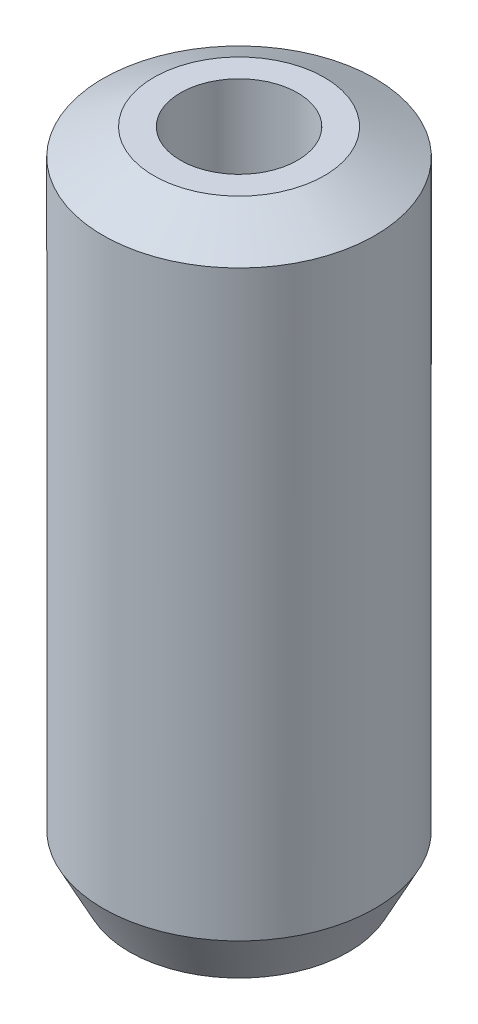
ISO-10303-21;
HEADER;
FILE_DESCRIPTION(('STEP AP214'),'2;1');
FILE_NAME('part.step','',(''),(''),'','','');
FILE_SCHEMA(('AUTOMOTIVE_DESIGN { 1 0 10303 214 1 1 1 1 }'));
ENDSEC;
DATA;
#1=APPLICATION_CONTEXT('core data for automotive mechanical design processes');
#2=APPLICATION_PROTOCOL_DEFINITION('international standard','automotive_design',2000,#1);
#3=PRODUCT_CONTEXT('',#1,'mechanical');
#4=PRODUCT('Part','Part','',(#3));
#5=PRODUCT_RELATED_PRODUCT_CATEGORY('part','',(#4));
#6=PRODUCT_DEFINITION_FORMATION('','',#4);
#7=PRODUCT_DEFINITION_CONTEXT('part definition',#1,'design');
#8=PRODUCT_DEFINITION('design','',#6,#7);
#9=PRODUCT_DEFINITION_SHAPE('','',#8);
#10=(LENGTH_UNIT() NAMED_UNIT(*) SI_UNIT(.MILLI.,.METRE.));
#11=(NAMED_UNIT(*) PLANE_ANGLE_UNIT() SI_UNIT($,.RADIAN.));
#12=(NAMED_UNIT(*) SI_UNIT($,.STERADIAN.) SOLID_ANGLE_UNIT());
#13=UNCERTAINTY_MEASURE_WITH_UNIT(LENGTH_MEASURE(1.E-05),#10,'distance_accuracy_value','');
#14=(GEOMETRIC_REPRESENTATION_CONTEXT(3) GLOBAL_UNCERTAINTY_ASSIGNED_CONTEXT((#13)) GLOBAL_UNIT_ASSIGNED_CONTEXT((#10,
#11,#12)) REPRESENTATION_CONTEXT('',''));
#15=CARTESIAN_POINT('',(0.,0.,0.));
#16=DIRECTION('',(0.,0.,1.));
#17=DIRECTION('',(1.,0.,0.));
#18=AXIS2_PLACEMENT_3D('',#15,#16,#17);
#19=CARTESIAN_POINT('',(0.,72.7821540167197,0.));
#20=DIRECTION('',(0.,-1.,0.));
#21=DIRECTION('',(0.,0.,-1.));
#22=AXIS2_PLACEMENT_3D('',#19,#20,#21);
#23=CYLINDRICAL_SURFACE('',#22,15.);
#24=CARTESIAN_POINT('',(0.,69.8770734885181,0.));
#25=DIRECTION('',(0.,1.,0.));
#26=DIRECTION('',(0.,0.,1.));
#27=AXIS2_PLACEMENT_3D('',#24,#25,#26);
#28=CIRCLE('',#27,15.);
#29=CARTESIAN_POINT('',(0.,69.8770734885181,-15.));
#30=VERTEX_POINT('',#29);
#31=EDGE_CURVE('E50',#30,#30,#28,.F.);
#32=ORIENTED_EDGE('',*,*,#31,.T.);
#33=EDGE_LOOP('',(#32));
#34=FACE_BOUND('',#33,.T.);
#35=CARTESIAN_POINT('',(0.,5.59851978660866,0.));
#36=DIRECTION('',(0.,1.,0.));
#37=DIRECTION('',(0.,0.,1.));
#38=AXIS2_PLACEMENT_3D('',#35,#36,#37);
#39=CIRCLE('',#38,15.);
#40=CARTESIAN_POINT('',(0.,5.59851978660866,15.));
#41=VERTEX_POINT('',#40);
#42=EDGE_CURVE('E51',#41,#41,#39,.T.);
#43=ORIENTED_EDGE('',*,*,#42,.T.);
#44=EDGE_LOOP('',(#43));
#45=FACE_BOUND('',#44,.T.);
#46=ADVANCED_FACE('F39',(#34,#45),#23,.T.);
#47=CARTESIAN_POINT('',(0.,72.7821540167197,0.));
#48=DIRECTION('',(0.,1.,0.));
#49=DIRECTION('',(0.,0.,1.));
#50=AXIS2_PLACEMENT_3D('',#47,#48,#49);
#51=PLANE('',#50);
#52=CARTESIAN_POINT('',(0.,72.7821540167197,0.));
#53=DIRECTION('',(0.,1.,0.));
#54=DIRECTION('',(0.,0.,1.));
#55=AXIS2_PLACEMENT_3D('',#52,#53,#54);
#56=CIRCLE('',#55,9.40148021339141);
#57=CARTESIAN_POINT('',(0.,72.7821540167197,-9.40148021339142));
#58=VERTEX_POINT('',#57);
#59=EDGE_CURVE('E54',#58,#58,#56,.T.);
#60=ORIENTED_EDGE('',*,*,#59,.T.);
#61=EDGE_LOOP('',(#60));
#62=FACE_BOUND('',#61,.T.);
#63=CARTESIAN_POINT('',(0.,72.7821540167197,0.));
#64=DIRECTION('',(0.,1.,0.));
#65=DIRECTION('',(0.,0.,1.));
#66=AXIS2_PLACEMENT_3D('',#63,#64,#65);
#67=CIRCLE('',#66,6.45590871518805);
#68=CARTESIAN_POINT('',(0.,72.7821540167197,6.45590871518805));
#69=VERTEX_POINT('',#68);
#70=EDGE_CURVE('E58',#69,#69,#67,.T.);
#71=ORIENTED_EDGE('',*,*,#70,.F.);
#72=EDGE_LOOP('',(#71));
#73=FACE_BOUND('',#72,.T.);
#74=ADVANCED_FACE('F69',(#62,#73),#51,.T.);
#75=CARTESIAN_POINT('',(0.,0.,0.));
#76=DIRECTION('',(0.,1.,0.));
#77=DIRECTION('',(0.,0.,1.));
#78=AXIS2_PLACEMENT_3D('',#75,#76,#77);
#79=PLANE('',#78);
#80=CARTESIAN_POINT('',(0.,0.,0.));
#81=DIRECTION('',(0.,1.,0.));
#82=DIRECTION('',(0.,0.,1.));
#83=AXIS2_PLACEMENT_3D('',#80,#81,#82);
#84=CIRCLE('',#83,12.0949194717984);
#85=CARTESIAN_POINT('',(0.,0.,12.0949194717984));
#86=VERTEX_POINT('',#85);
#87=EDGE_CURVE('E10',#86,#86,#84,.F.);
#88=ORIENTED_EDGE('',*,*,#87,.T.);
#89=EDGE_LOOP('',(#88));
#90=FACE_BOUND('',#89,.T.);
#91=CARTESIAN_POINT('',(0.,0.,0.));
#92=DIRECTION('',(0.,1.,0.));
#93=DIRECTION('',(0.,0.,1.));
#94=AXIS2_PLACEMENT_3D('',#91,#92,#93);
#95=CIRCLE('',#94,6.45590871518805);
#96=CARTESIAN_POINT('',(0.,0.,6.45590871518805));
#97=VERTEX_POINT('',#96);
#98=EDGE_CURVE('E63',#97,#97,#95,.T.);
#99=ORIENTED_EDGE('',*,*,#98,.T.);
#100=EDGE_LOOP('',(#99));
#101=FACE_BOUND('',#100,.T.);
#102=ADVANCED_FACE('F75',(#90,#101),#79,.F.);
#103=CARTESIAN_POINT('',(0.,72.7821540167197,0.));
#104=DIRECTION('',(0.,-1.,0.));
#105=DIRECTION('',(0.,0.,-1.));
#106=AXIS2_PLACEMENT_3D('',#103,#104,#105);
#107=CYLINDRICAL_SURFACE('',#106,6.45590871518805);
#108=ORIENTED_EDGE('',*,*,#70,.T.);
#109=EDGE_LOOP('',(#108));
#110=FACE_BOUND('',#109,.T.);
#111=ORIENTED_EDGE('',*,*,#98,.F.);
#112=EDGE_LOOP('',(#111));
#113=FACE_BOUND('',#112,.T.);
#114=ADVANCED_FACE('F70',(#110,#113),#107,.F.);
#115=CARTESIAN_POINT('',(0.,72.7821540167197,0.));
#116=DIRECTION('',(0.,-1.,0.));
#117=DIRECTION('',(0.,0.,-1.));
#118=AXIS2_PLACEMENT_3D('',#115,#116,#117);
#119=CONICAL_SURFACE('',#118,9.40148021339141,1.09214208184919);
#120=CARTESIAN_POINT('',(0.,69.8770734885181,-15.));
#121=CARTESIAN_POINT('',(0.,69.9073347440202,-14.9416820855562));
#122=CARTESIAN_POINT('',(0.,69.9375959995223,-14.8833641711123));
#123=CARTESIAN_POINT('',(0.,69.9981185105265,-14.7667283422247));
#124=CARTESIAN_POINT('',(0.,70.0283797660286,-14.7084104277808));
#125=CARTESIAN_POINT('',(0.,70.0889022770328,-14.5917745988931));
#126=CARTESIAN_POINT('',(0.,70.1191635325349,-14.5334566844493));
#127=CARTESIAN_POINT('',(0.,70.1796860435391,-14.4168208555616));
#128=CARTESIAN_POINT('',(0.,70.2099472990412,-14.3585029411178));
#129=CARTESIAN_POINT('',(0.,70.2704698100454,-14.2418671122301));
#130=CARTESIAN_POINT('',(0.,70.3007310655475,-14.1835491977863));
#131=CARTESIAN_POINT('',(0.,70.3612535765517,-14.0669133688986));
#132=CARTESIAN_POINT('',(0.,70.3915148320538,-14.0085954544547));
#133=CARTESIAN_POINT('',(0.,70.452037343058,-13.8919596255671));
#134=CARTESIAN_POINT('',(0.,70.4822985985601,-13.8336417111232));
#135=CARTESIAN_POINT('',(0.,70.5428211095643,-13.7170058822355));
#136=CARTESIAN_POINT('',(0.,70.5730823650664,-13.6586879677917));
#137=CARTESIAN_POINT('',(0.,70.6336048760706,-13.542052138904));
#138=CARTESIAN_POINT('',(0.,70.6638661315727,-13.4837342244602));
#139=CARTESIAN_POINT('',(0.,70.7243886425769,-13.3670983955725));
#140=CARTESIAN_POINT('',(0.,70.754649898079,-13.3087804811287));
#141=CARTESIAN_POINT('',(0.,70.8151724090832,-13.192144652241));
#142=CARTESIAN_POINT('',(0.,70.8454336645853,-13.1338267377971));
#143=CARTESIAN_POINT('',(0.,70.9059561755895,-13.0171909089095));
#144=CARTESIAN_POINT('',(0.,70.9362174310916,-12.9588729944656));
#145=CARTESIAN_POINT('',(0.,70.9967399420958,-12.842237165578));
#146=CARTESIAN_POINT('',(0.,71.0270011975979,-12.7839192511341));
#147=CARTESIAN_POINT('',(0.,71.0875237086021,-12.6672834222464));
#148=CARTESIAN_POINT('',(0.,71.1177849641042,-12.6089655078026));
#149=CARTESIAN_POINT('',(0.,71.1783074751084,-12.4923296789149));
#150=CARTESIAN_POINT('',(0.,71.2085687306105,-12.4340117644711));
#151=CARTESIAN_POINT('',(0.,71.2690912416147,-12.3173759355834));
#152=CARTESIAN_POINT('',(0.,71.2993524971168,-12.2590580211396));
#153=CARTESIAN_POINT('',(0.,71.359875008121,-12.1424221922519));
#154=CARTESIAN_POINT('',(0.,71.3901362636231,-12.084104277808));
#155=CARTESIAN_POINT('',(0.,71.4506587746273,-11.9674684489204));
#156=CARTESIAN_POINT('',(0.,71.4809200301294,-11.9091505344765));
#157=CARTESIAN_POINT('',(0.,71.5414425411336,-11.7925147055888));
#158=CARTESIAN_POINT('',(0.,71.5717037966357,-11.734196791145));
#159=CARTESIAN_POINT('',(0.,71.6322263076399,-11.6175609622573));
#160=CARTESIAN_POINT('',(0.,71.662487563142,-11.5592430478135));
#161=CARTESIAN_POINT('',(0.,71.7230100741462,-11.4426072189258));
#162=CARTESIAN_POINT('',(0.,71.7532713296483,-11.384289304482));
#163=CARTESIAN_POINT('',(0.,71.8137938406525,-11.2676534755943));
#164=CARTESIAN_POINT('',(0.,71.8440550961546,-11.2093355611504));
#165=CARTESIAN_POINT('',(0.,71.9045776071588,-11.0926997322628));
#166=CARTESIAN_POINT('',(0.,71.9348388626609,-11.0343818178189));
#167=CARTESIAN_POINT('',(0.,71.9953613736651,-10.9177459889312));
#168=CARTESIAN_POINT('',(0.,72.0256226291672,-10.8594280744874));
#169=CARTESIAN_POINT('',(0.,72.0861451401714,-10.7427922455997));
#170=CARTESIAN_POINT('',(0.,72.1164063956735,-10.6844743311559));
#171=CARTESIAN_POINT('',(0.,72.1769289066777,-10.5678385022682));
#172=CARTESIAN_POINT('',(0.,72.2071901621798,-10.5095205878244));
#173=CARTESIAN_POINT('',(0.,72.267712673184,-10.3928847589367));
#174=CARTESIAN_POINT('',(0.,72.2979739286861,-10.3345668444929));
#175=CARTESIAN_POINT('',(0.,72.3584964396903,-10.2179310156052));
#176=CARTESIAN_POINT('',(0.,72.3887576951924,-10.1596131011613));
#177=CARTESIAN_POINT('',(0.,72.4492802061966,-10.0429772722737));
#178=CARTESIAN_POINT('',(0.,72.4795414616987,-9.98465935782981));
#179=CARTESIAN_POINT('',(0.,72.5400639727029,-9.86802352894214));
#180=CARTESIAN_POINT('',(0.,72.570325228205,-9.8097056144983));
#181=CARTESIAN_POINT('',(0.,72.6308477392092,-9.69306978561062));
#182=CARTESIAN_POINT('',(0.,72.6611089947113,-9.63475187116678));
#183=CARTESIAN_POINT('',(0.,72.7216315057155,-9.5181160422791));
#184=CARTESIAN_POINT('',(0.,72.7518927612176,-9.45979812783526));
#185=CARTESIAN_POINT('',(0.,72.7821540167197,-9.40148021339142));
#186=B_SPLINE_CURVE_WITH_KNOTS('',3,(#120,#121,#122,#123,#124,#125,#126,#127,#128,#129,#130,
#131,#132,#133,#134,#135,#136,#137,#138,#139,#140,#141,#142,#143,#144,#145,#146,#147,#148,#149,
#150,#151,#152,#153,#154,#155,#156,#157,#158,#159,#160,#161,#162,#163,#164,#165,#166,#167,#168,
#169,#170,#171,#172,#173,#174,#175,#176,#177,#178,#179,#180,#181,#182,#183,#184,#185),
.UNSPECIFIED.,.F.,.F.,(4,2,2,2,2,2,2,2,2,2,2,2,2,2,2,2,2,2,2,2,2,2,2,2,2,2,2,2,2,2,2,2,4),(0.,
0.197105313390535,0.394210626781072,0.591315940171607,0.788421253562143,0.985526566952679,
1.18263188034321,1.37973719373374,1.57684250712428,1.77394782051482,1.97105313390535,
2.16815844729589,2.36526376068642,2.56236907407695,2.75947438746749,2.95657970085802,
3.15368501424856,3.35079032763909,3.54789564102963,3.74500095442017,3.94210626781069,
4.13921158120123,4.33631689459177,4.5334222079823,4.73052752137284,4.92763283476337,
5.1247381481539,5.32184346154444,5.51894877493497,5.71605408832551,5.91315940171605,
6.11026471510658,6.30737002849712),.UNSPECIFIED.);
#187=EDGE_CURVE('BSEAM81',#30,#58,#186,.T.);
#188=ORIENTED_EDGE('',*,*,#31,.F.);
#189=ORIENTED_EDGE('',*,*,#59,.F.);
#190=ORIENTED_EDGE('',*,*,#187,.T.);
#191=ORIENTED_EDGE('',*,*,#187,.F.);
#192=EDGE_LOOP('',(#188,#190,#189,#191));
#193=FACE_BOUND('',#192,.T.);
#194=ADVANCED_FACE('F81',(#193),#119,.T.);
#195=CARTESIAN_POINT('',(0.,5.59851978660866,0.));
#196=DIRECTION('',(0.,1.,0.));
#197=DIRECTION('',(0.,0.,1.));
#198=AXIS2_PLACEMENT_3D('',#195,#196,#197);
#199=CONICAL_SURFACE('',#198,15.,0.478654244945703);
#200=ORIENTED_EDGE('',*,*,#87,.F.);
#201=EDGE_LOOP('',(#200));
#202=FACE_BOUND('',#201,.T.);
#203=ORIENTED_EDGE('',*,*,#42,.F.);
#204=EDGE_LOOP('',(#203));
#205=FACE_BOUND('',#204,.T.);
#206=ADVANCED_FACE('F45',(#202,#205),#199,.T.);
#207=CLOSED_SHELL('',(#46,#74,#102,#114,#194,#206));
#208=MANIFOLD_SOLID_BREP('B2',#207);
#209=ADVANCED_BREP_SHAPE_REPRESENTATION('',(#18,#208),#14);
#210=SHAPE_DEFINITION_REPRESENTATION(#9,#209);
ENDSEC;
END-ISO-10303-21;
